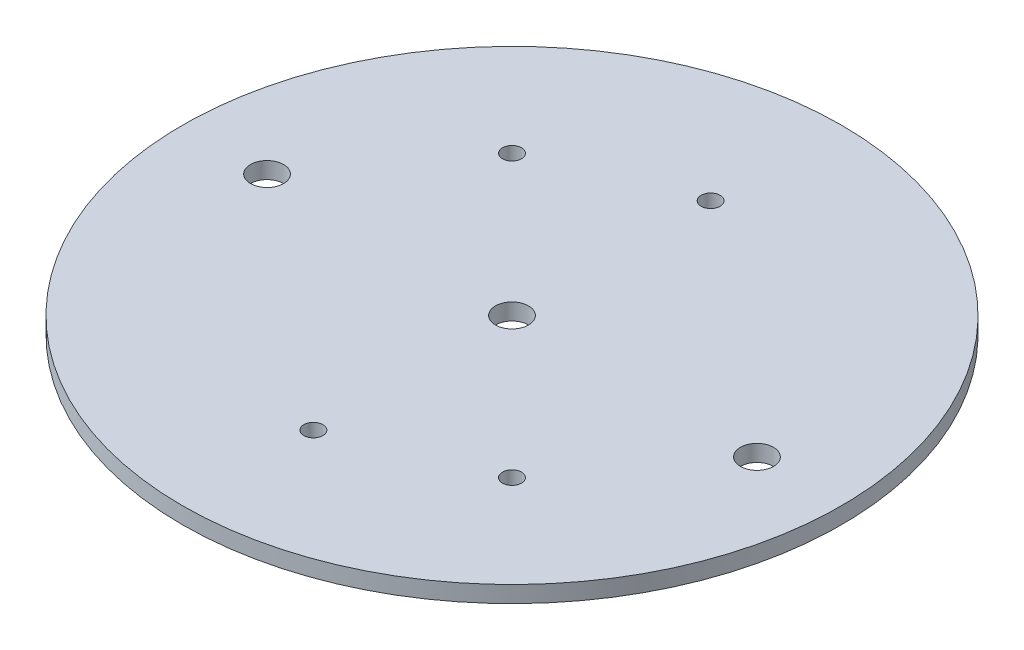
ISO-10303-21;
HEADER;
FILE_DESCRIPTION(('STEP AP214'),'2;1');
FILE_NAME('part.step','',(''),(''),'','','');
FILE_SCHEMA(('AUTOMOTIVE_DESIGN { 1 0 10303 214 1 1 1 1 }'));
ENDSEC;
DATA;
#1=APPLICATION_CONTEXT('core data for automotive mechanical design processes');
#2=APPLICATION_PROTOCOL_DEFINITION('international standard','automotive_design',2000,#1);
#3=PRODUCT_CONTEXT('',#1,'mechanical');
#4=PRODUCT('Part','Part','',(#3));
#5=PRODUCT_RELATED_PRODUCT_CATEGORY('part','',(#4));
#6=PRODUCT_DEFINITION_FORMATION('','',#4);
#7=PRODUCT_DEFINITION_CONTEXT('part definition',#1,'design');
#8=PRODUCT_DEFINITION('design','',#6,#7);
#9=PRODUCT_DEFINITION_SHAPE('','',#8);
#10=(LENGTH_UNIT() NAMED_UNIT(*) SI_UNIT(.MILLI.,.METRE.));
#11=(NAMED_UNIT(*) PLANE_ANGLE_UNIT() SI_UNIT($,.RADIAN.));
#12=(NAMED_UNIT(*) SI_UNIT($,.STERADIAN.) SOLID_ANGLE_UNIT());
#13=UNCERTAINTY_MEASURE_WITH_UNIT(LENGTH_MEASURE(1.E-05),#10,'distance_accuracy_value','');
#14=(GEOMETRIC_REPRESENTATION_CONTEXT(3) GLOBAL_UNCERTAINTY_ASSIGNED_CONTEXT((#13)) GLOBAL_UNIT_ASSIGNED_CONTEXT((#10,
#11,#12)) REPRESENTATION_CONTEXT('',''));
#15=CARTESIAN_POINT('',(0.,0.,0.));
#16=DIRECTION('',(0.,0.,1.));
#17=DIRECTION('',(1.,0.,0.));
#18=AXIS2_PLACEMENT_3D('',#15,#16,#17);
#19=CARTESIAN_POINT('',(0.,3.175,0.));
#20=DIRECTION('',(0.,1.,0.));
#21=DIRECTION('',(0.,0.,1.));
#22=AXIS2_PLACEMENT_3D('',#19,#20,#21);
#23=PLANE('',#22);
#24=CARTESIAN_POINT('',(-26.9407683632074,3.175,-26.9407683632075));
#25=DIRECTION('',(0.,1.,0.));
#26=DIRECTION('',(0.,0.,1.));
#27=AXIS2_PLACEMENT_3D('',#24,#25,#26);
#28=CIRCLE('',#27,1.8288);
#29=CARTESIAN_POINT('',(-26.9407683632074,3.175,-25.1119683632075));
#30=VERTEX_POINT('',#29);
#31=EDGE_CURVE('E92',#30,#30,#28,.T.);
#32=ORIENTED_EDGE('',*,*,#31,.F.);
#33=EDGE_LOOP('',(#32));
#34=FACE_BOUND('',#33,.T.);
#35=CARTESIAN_POINT('',(0.,3.175,-38.1));
#36=DIRECTION('',(0.,1.,0.));
#37=DIRECTION('',(0.,0.,1.));
#38=AXIS2_PLACEMENT_3D('',#35,#36,#37);
#39=CIRCLE('',#38,1.8288);
#40=CARTESIAN_POINT('',(0.,3.175,-36.2712));
#41=VERTEX_POINT('',#40);
#42=EDGE_CURVE('E76',#41,#41,#39,.T.);
#43=ORIENTED_EDGE('',*,*,#42,.F.);
#44=EDGE_LOOP('',(#43));
#45=FACE_BOUND('',#44,.T.);
#46=CARTESIAN_POINT('',(46.99,3.175,0.));
#47=DIRECTION('',(0.,1.,0.));
#48=DIRECTION('',(0.,0.,1.));
#49=AXIS2_PLACEMENT_3D('',#46,#47,#48);
#50=CIRCLE('',#49,3.175);
#51=CARTESIAN_POINT('',(46.99,3.175,3.17499999999998));
#52=VERTEX_POINT('',#51);
#53=EDGE_CURVE('E60',#52,#52,#50,.T.);
#54=ORIENTED_EDGE('',*,*,#53,.F.);
#55=EDGE_LOOP('',(#54));
#56=FACE_BOUND('',#55,.T.);
#57=CARTESIAN_POINT('',(0.,3.175,0.));
#58=DIRECTION('',(0.,1.,0.));
#59=DIRECTION('',(0.,0.,1.));
#60=AXIS2_PLACEMENT_3D('',#57,#58,#59);
#61=CIRCLE('',#60,63.2206);
#62=CARTESIAN_POINT('',(0.,3.175,63.2206));
#63=VERTEX_POINT('',#62);
#64=EDGE_CURVE('E10',#63,#63,#61,.T.);
#65=ORIENTED_EDGE('',*,*,#64,.T.);
#66=EDGE_LOOP('',(#65));
#67=FACE_BOUND('',#66,.T.);
#68=CARTESIAN_POINT('',(-46.99,3.175,0.));
#69=DIRECTION('',(0.,1.,0.));
#70=DIRECTION('',(0.,0.,1.));
#71=AXIS2_PLACEMENT_3D('',#68,#69,#70);
#72=CIRCLE('',#71,3.175);
#73=CARTESIAN_POINT('',(-46.99,3.175,3.175));
#74=VERTEX_POINT('',#73);
#75=EDGE_CURVE('E54',#74,#74,#72,.T.);
#76=ORIENTED_EDGE('',*,*,#75,.F.);
#77=EDGE_LOOP('',(#76));
#78=FACE_BOUND('',#77,.T.);
#79=CARTESIAN_POINT('',(0.,3.175,0.));
#80=DIRECTION('',(0.,1.,0.));
#81=DIRECTION('',(0.,0.,1.));
#82=AXIS2_PLACEMENT_3D('',#79,#80,#81);
#83=CIRCLE('',#82,3.175);
#84=CARTESIAN_POINT('',(0.,3.175,3.175));
#85=VERTEX_POINT('',#84);
#86=EDGE_CURVE('E68',#85,#85,#83,.T.);
#87=ORIENTED_EDGE('',*,*,#86,.F.);
#88=EDGE_LOOP('',(#87));
#89=FACE_BOUND('',#88,.T.);
#90=CARTESIAN_POINT('',(0.,3.175,38.1));
#91=DIRECTION('',(0.,1.,0.));
#92=DIRECTION('',(0.,0.,1.));
#93=AXIS2_PLACEMENT_3D('',#90,#91,#92);
#94=CIRCLE('',#93,1.8288);
#95=CARTESIAN_POINT('',(0.,3.175,39.9288));
#96=VERTEX_POINT('',#95);
#97=EDGE_CURVE('E84',#96,#96,#94,.T.);
#98=ORIENTED_EDGE('',*,*,#97,.F.);
#99=EDGE_LOOP('',(#98));
#100=FACE_BOUND('',#99,.T.);
#101=CARTESIAN_POINT('',(26.9407683632074,3.175,26.9407683632075));
#102=DIRECTION('',(0.,1.,0.));
#103=DIRECTION('',(0.,0.,1.));
#104=AXIS2_PLACEMENT_3D('',#101,#102,#103);
#105=CIRCLE('',#104,1.8288);
#106=CARTESIAN_POINT('',(26.9407683632074,3.175,28.7695683632075));
#107=VERTEX_POINT('',#106);
#108=EDGE_CURVE('E100',#107,#107,#105,.T.);
#109=ORIENTED_EDGE('',*,*,#108,.F.);
#110=EDGE_LOOP('',(#109));
#111=FACE_BOUND('',#110,.T.);
#112=ADVANCED_FACE('F41',(#34,#45,#56,#67,#78,#89,#100,#111),#23,.T.);
#113=CARTESIAN_POINT('',(0.,0.,0.));
#114=DIRECTION('',(0.,1.,0.));
#115=DIRECTION('',(0.,0.,1.));
#116=AXIS2_PLACEMENT_3D('',#113,#114,#115);
#117=PLANE('',#116);
#118=CARTESIAN_POINT('',(0.,0.,0.));
#119=DIRECTION('',(0.,1.,0.));
#120=DIRECTION('',(0.,0.,1.));
#121=AXIS2_PLACEMENT_3D('',#118,#119,#120);
#122=CIRCLE('',#121,63.2206);
#123=CARTESIAN_POINT('',(0.,0.,63.2206));
#124=VERTEX_POINT('',#123);
#125=EDGE_CURVE('E45',#124,#124,#122,.T.);
#126=ORIENTED_EDGE('',*,*,#125,.F.);
#127=EDGE_LOOP('',(#126));
#128=FACE_BOUND('',#127,.T.);
#129=CARTESIAN_POINT('',(-46.99,0.,0.));
#130=DIRECTION('',(0.,1.,0.));
#131=DIRECTION('',(0.,0.,1.));
#132=AXIS2_PLACEMENT_3D('',#129,#130,#131);
#133=CIRCLE('',#132,3.175);
#134=CARTESIAN_POINT('',(-46.99,0.,3.175));
#135=VERTEX_POINT('',#134);
#136=EDGE_CURVE('E56',#135,#135,#133,.T.);
#137=ORIENTED_EDGE('',*,*,#136,.T.);
#138=EDGE_LOOP('',(#137));
#139=FACE_BOUND('',#138,.T.);
#140=CARTESIAN_POINT('',(46.99,0.,0.));
#141=DIRECTION('',(0.,1.,0.));
#142=DIRECTION('',(0.,0.,1.));
#143=AXIS2_PLACEMENT_3D('',#140,#141,#142);
#144=CIRCLE('',#143,3.175);
#145=CARTESIAN_POINT('',(46.99,0.,3.17499999999998));
#146=VERTEX_POINT('',#145);
#147=EDGE_CURVE('E64',#146,#146,#144,.T.);
#148=ORIENTED_EDGE('',*,*,#147,.T.);
#149=EDGE_LOOP('',(#148));
#150=FACE_BOUND('',#149,.T.);
#151=CARTESIAN_POINT('',(0.,0.,0.));
#152=DIRECTION('',(0.,1.,0.));
#153=DIRECTION('',(0.,0.,1.));
#154=AXIS2_PLACEMENT_3D('',#151,#152,#153);
#155=CIRCLE('',#154,3.175);
#156=CARTESIAN_POINT('',(0.,0.,3.175));
#157=VERTEX_POINT('',#156);
#158=EDGE_CURVE('E72',#157,#157,#155,.T.);
#159=ORIENTED_EDGE('',*,*,#158,.T.);
#160=EDGE_LOOP('',(#159));
#161=FACE_BOUND('',#160,.T.);
#162=CARTESIAN_POINT('',(0.,0.,-38.1));
#163=DIRECTION('',(0.,1.,0.));
#164=DIRECTION('',(0.,0.,1.));
#165=AXIS2_PLACEMENT_3D('',#162,#163,#164);
#166=CIRCLE('',#165,1.8288);
#167=CARTESIAN_POINT('',(0.,0.,-36.2712));
#168=VERTEX_POINT('',#167);
#169=EDGE_CURVE('E80',#168,#168,#166,.T.);
#170=ORIENTED_EDGE('',*,*,#169,.T.);
#171=EDGE_LOOP('',(#170));
#172=FACE_BOUND('',#171,.T.);
#173=CARTESIAN_POINT('',(0.,0.,38.1));
#174=DIRECTION('',(0.,1.,0.));
#175=DIRECTION('',(0.,0.,1.));
#176=AXIS2_PLACEMENT_3D('',#173,#174,#175);
#177=CIRCLE('',#176,1.8288);
#178=CARTESIAN_POINT('',(0.,0.,39.9288));
#179=VERTEX_POINT('',#178);
#180=EDGE_CURVE('E88',#179,#179,#177,.T.);
#181=ORIENTED_EDGE('',*,*,#180,.T.);
#182=EDGE_LOOP('',(#181));
#183=FACE_BOUND('',#182,.T.);
#184=CARTESIAN_POINT('',(-26.9407683632074,0.,-26.9407683632075));
#185=DIRECTION('',(0.,1.,0.));
#186=DIRECTION('',(0.,0.,1.));
#187=AXIS2_PLACEMENT_3D('',#184,#185,#186);
#188=CIRCLE('',#187,1.8288);
#189=CARTESIAN_POINT('',(-26.9407683632074,0.,-25.1119683632075));
#190=VERTEX_POINT('',#189);
#191=EDGE_CURVE('E96',#190,#190,#188,.T.);
#192=ORIENTED_EDGE('',*,*,#191,.T.);
#193=EDGE_LOOP('',(#192));
#194=FACE_BOUND('',#193,.T.);
#195=CARTESIAN_POINT('',(26.9407683632074,0.,26.9407683632075));
#196=DIRECTION('',(0.,1.,0.));
#197=DIRECTION('',(0.,0.,1.));
#198=AXIS2_PLACEMENT_3D('',#195,#196,#197);
#199=CIRCLE('',#198,1.8288);
#200=CARTESIAN_POINT('',(26.9407683632074,0.,28.7695683632075));
#201=VERTEX_POINT('',#200);
#202=EDGE_CURVE('E104',#201,#201,#199,.T.);
#203=ORIENTED_EDGE('',*,*,#202,.T.);
#204=EDGE_LOOP('',(#203));
#205=FACE_BOUND('',#204,.T.);
#206=ADVANCED_FACE('F116',(#128,#139,#150,#161,#172,#183,#194,#205),#117,.F.);
#207=CARTESIAN_POINT('',(0.,3.175,0.));
#208=DIRECTION('',(0.,-1.,0.));
#209=DIRECTION('',(0.,0.,-1.));
#210=AXIS2_PLACEMENT_3D('',#207,#208,#209);
#211=CYLINDRICAL_SURFACE('',#210,63.2206);
#212=ORIENTED_EDGE('',*,*,#64,.F.);
#213=EDGE_LOOP('',(#212));
#214=FACE_BOUND('',#213,.T.);
#215=ORIENTED_EDGE('',*,*,#125,.T.);
#216=EDGE_LOOP('',(#215));
#217=FACE_BOUND('',#216,.T.);
#218=ADVANCED_FACE('F43',(#214,#217),#211,.T.);
#219=CARTESIAN_POINT('',(-46.99,3.175,0.));
#220=DIRECTION('',(0.,-1.,0.));
#221=DIRECTION('',(0.,0.,-1.));
#222=AXIS2_PLACEMENT_3D('',#219,#220,#221);
#223=CYLINDRICAL_SURFACE('',#222,3.175);
#224=ORIENTED_EDGE('',*,*,#75,.T.);
#225=EDGE_LOOP('',(#224));
#226=FACE_BOUND('',#225,.T.);
#227=ORIENTED_EDGE('',*,*,#136,.F.);
#228=EDGE_LOOP('',(#227));
#229=FACE_BOUND('',#228,.T.);
#230=ADVANCED_FACE('F126',(#226,#229),#223,.F.);
#231=CARTESIAN_POINT('',(46.99,3.175,0.));
#232=DIRECTION('',(0.,-1.,0.));
#233=DIRECTION('',(0.,0.,-1.));
#234=AXIS2_PLACEMENT_3D('',#231,#232,#233);
#235=CYLINDRICAL_SURFACE('',#234,3.175);
#236=ORIENTED_EDGE('',*,*,#53,.T.);
#237=EDGE_LOOP('',(#236));
#238=FACE_BOUND('',#237,.T.);
#239=ORIENTED_EDGE('',*,*,#147,.F.);
#240=EDGE_LOOP('',(#239));
#241=FACE_BOUND('',#240,.T.);
#242=ADVANCED_FACE('F129',(#238,#241),#235,.F.);
#243=CARTESIAN_POINT('',(0.,3.175,0.));
#244=DIRECTION('',(0.,-1.,0.));
#245=DIRECTION('',(0.,0.,-1.));
#246=AXIS2_PLACEMENT_3D('',#243,#244,#245);
#247=CYLINDRICAL_SURFACE('',#246,3.175);
#248=ORIENTED_EDGE('',*,*,#86,.T.);
#249=EDGE_LOOP('',(#248));
#250=FACE_BOUND('',#249,.T.);
#251=ORIENTED_EDGE('',*,*,#158,.F.);
#252=EDGE_LOOP('',(#251));
#253=FACE_BOUND('',#252,.T.);
#254=ADVANCED_FACE('F133',(#250,#253),#247,.F.);
#255=CARTESIAN_POINT('',(0.,3.175,-38.1));
#256=DIRECTION('',(0.,-1.,0.));
#257=DIRECTION('',(0.,0.,-1.));
#258=AXIS2_PLACEMENT_3D('',#255,#256,#257);
#259=CYLINDRICAL_SURFACE('',#258,1.8288);
#260=ORIENTED_EDGE('',*,*,#42,.T.);
#261=EDGE_LOOP('',(#260));
#262=FACE_BOUND('',#261,.T.);
#263=ORIENTED_EDGE('',*,*,#169,.F.);
#264=EDGE_LOOP('',(#263));
#265=FACE_BOUND('',#264,.T.);
#266=ADVANCED_FACE('F137',(#262,#265),#259,.F.);
#267=CARTESIAN_POINT('',(0.,3.175,38.1));
#268=DIRECTION('',(0.,-1.,0.));
#269=DIRECTION('',(0.,0.,-1.));
#270=AXIS2_PLACEMENT_3D('',#267,#268,#269);
#271=CYLINDRICAL_SURFACE('',#270,1.8288);
#272=ORIENTED_EDGE('',*,*,#97,.T.);
#273=EDGE_LOOP('',(#272));
#274=FACE_BOUND('',#273,.T.);
#275=ORIENTED_EDGE('',*,*,#180,.F.);
#276=EDGE_LOOP('',(#275));
#277=FACE_BOUND('',#276,.T.);
#278=ADVANCED_FACE('F141',(#274,#277),#271,.F.);
#279=CARTESIAN_POINT('',(-26.9407683632074,3.175,-26.9407683632075));
#280=DIRECTION('',(0.,-1.,0.));
#281=DIRECTION('',(0.,0.,-1.));
#282=AXIS2_PLACEMENT_3D('',#279,#280,#281);
#283=CYLINDRICAL_SURFACE('',#282,1.8288);
#284=ORIENTED_EDGE('',*,*,#31,.T.);
#285=EDGE_LOOP('',(#284));
#286=FACE_BOUND('',#285,.T.);
#287=ORIENTED_EDGE('',*,*,#191,.F.);
#288=EDGE_LOOP('',(#287));
#289=FACE_BOUND('',#288,.T.);
#290=ADVANCED_FACE('F145',(#286,#289),#283,.F.);
#291=CARTESIAN_POINT('',(26.9407683632074,3.175,26.9407683632075));
#292=DIRECTION('',(0.,-1.,0.));
#293=DIRECTION('',(0.,0.,-1.));
#294=AXIS2_PLACEMENT_3D('',#291,#292,#293);
#295=CYLINDRICAL_SURFACE('',#294,1.8288);
#296=ORIENTED_EDGE('',*,*,#108,.T.);
#297=EDGE_LOOP('',(#296));
#298=FACE_BOUND('',#297,.T.);
#299=ORIENTED_EDGE('',*,*,#202,.F.);
#300=EDGE_LOOP('',(#299));
#301=FACE_BOUND('',#300,.T.);
#302=ADVANCED_FACE('F112',(#298,#301),#295,.F.);
#303=CLOSED_SHELL('',(#112,#206,#218,#230,#242,#254,#266,#278,#290,#302));
#304=MANIFOLD_SOLID_BREP('B2',#303);
#305=ADVANCED_BREP_SHAPE_REPRESENTATION('',(#18,#304),#14);
#306=SHAPE_DEFINITION_REPRESENTATION(#9,#305);
ENDSEC;
END-ISO-10303-21;
